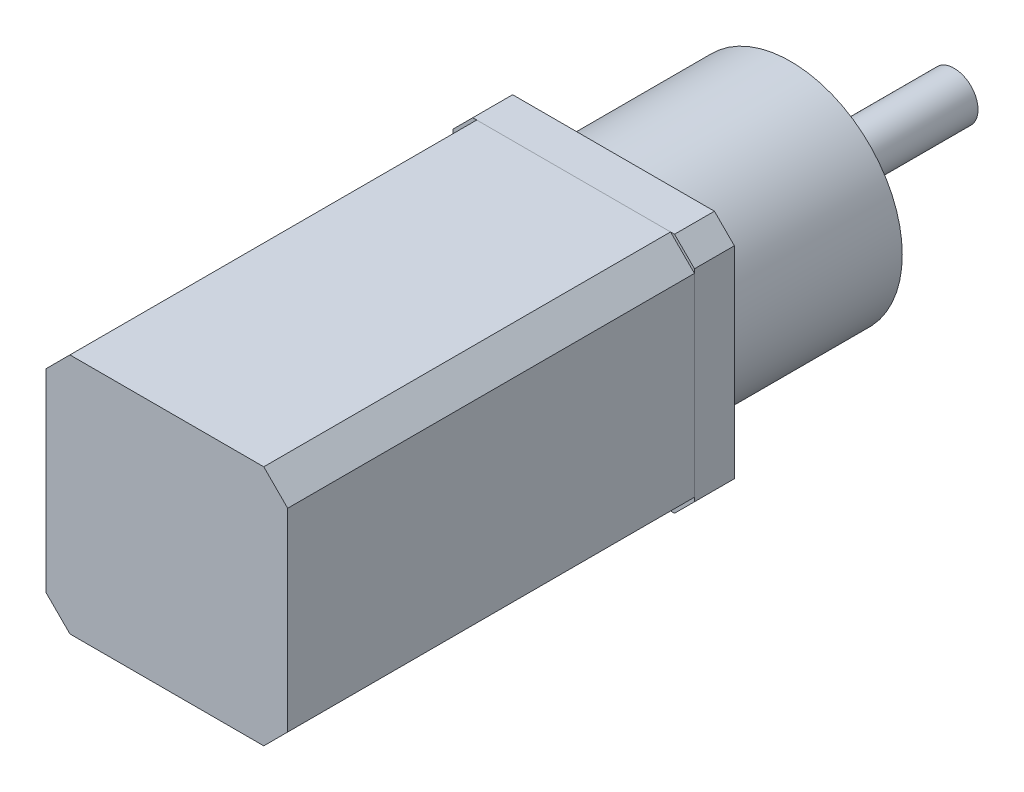
ISO-10303-21;
HEADER;
FILE_DESCRIPTION(('STEP AP214'),'2;1');
FILE_NAME('part.step','',(''),(''),'','','');
FILE_SCHEMA(('AUTOMOTIVE_DESIGN { 1 0 10303 214 1 1 1 1 }'));
ENDSEC;
DATA;
#1=APPLICATION_CONTEXT('core data for automotive mechanical design processes');
#2=APPLICATION_PROTOCOL_DEFINITION('international standard','automotive_design',2000,#1);
#3=PRODUCT_CONTEXT('',#1,'mechanical');
#4=PRODUCT('Part','Part','',(#3));
#5=PRODUCT_RELATED_PRODUCT_CATEGORY('part','',(#4));
#6=PRODUCT_DEFINITION_FORMATION('','',#4);
#7=PRODUCT_DEFINITION_CONTEXT('part definition',#1,'design');
#8=PRODUCT_DEFINITION('design','',#6,#7);
#9=PRODUCT_DEFINITION_SHAPE('','',#8);
#10=(LENGTH_UNIT() NAMED_UNIT(*) SI_UNIT(.MILLI.,.METRE.));
#11=(NAMED_UNIT(*) PLANE_ANGLE_UNIT() SI_UNIT($,.RADIAN.));
#12=(NAMED_UNIT(*) SI_UNIT($,.STERADIAN.) SOLID_ANGLE_UNIT());
#13=UNCERTAINTY_MEASURE_WITH_UNIT(LENGTH_MEASURE(1.E-05),#10,'distance_accuracy_value','');
#14=(GEOMETRIC_REPRESENTATION_CONTEXT(3) GLOBAL_UNCERTAINTY_ASSIGNED_CONTEXT((#13)) GLOBAL_UNIT_ASSIGNED_CONTEXT((#10,
#11,#12)) REPRESENTATION_CONTEXT('',''));
#15=CARTESIAN_POINT('',(0.,0.,0.));
#16=DIRECTION('',(0.,0.,1.));
#17=DIRECTION('',(1.,0.,0.));
#18=AXIS2_PLACEMENT_3D('',#15,#16,#17);
#19=CARTESIAN_POINT('',(-15.15,-15.15,-5.));
#20=DIRECTION('',(1.,0.,0.));
#21=DIRECTION('',(0.,0.,-1.));
#22=AXIS2_PLACEMENT_3D('',#19,#20,#21);
#23=PLANE('',#22);
#24=DIRECTION('',(0.,1.,0.));
#25=VECTOR('',#24,1.);
#26=CARTESIAN_POINT('',(-15.15,-15.15,-5.));
#27=LINE('',#26,#25);
#28=CARTESIAN_POINT('',(-15.15,-12.65,-5.));
#29=VERTEX_POINT('',#28);
#30=CARTESIAN_POINT('',(-15.15,12.65,-5.));
#31=VERTEX_POINT('',#30);
#32=EDGE_CURVE('E155',#29,#31,#27,.T.);
#33=ORIENTED_EDGE('',*,*,#32,.F.);
#34=DIRECTION('',(0.,0.,1.));
#35=VECTOR('',#34,1.);
#36=CARTESIAN_POINT('',(-15.15,-12.65,-5.));
#37=LINE('',#36,#35);
#38=CARTESIAN_POINT('',(-15.15,-12.65,0.));
#39=VERTEX_POINT('',#38);
#40=EDGE_CURVE('E14',#29,#39,#37,.T.);
#41=ORIENTED_EDGE('',*,*,#40,.T.);
#42=DIRECTION('',(0.,1.,0.));
#43=VECTOR('',#42,1.);
#44=CARTESIAN_POINT('',(-15.15,-15.15,0.));
#45=LINE('',#44,#43);
#46=CARTESIAN_POINT('',(-15.15,12.65,0.));
#47=VERTEX_POINT('',#46);
#48=EDGE_CURVE('E157',#39,#47,#45,.T.);
#49=ORIENTED_EDGE('',*,*,#48,.T.);
#50=DIRECTION('',(0.,0.,-1.));
#51=VECTOR('',#50,1.);
#52=CARTESIAN_POINT('',(-15.15,12.65,-5.));
#53=LINE('',#52,#51);
#54=EDGE_CURVE('E68',#47,#31,#53,.T.);
#55=ORIENTED_EDGE('',*,*,#54,.T.);
#56=EDGE_LOOP('',(#33,#41,#49,#55));
#57=FACE_BOUND('',#56,.T.);
#58=ADVANCED_FACE('F60',(#57),#23,.F.);
#59=CARTESIAN_POINT('',(15.15,15.15,-5.));
#60=DIRECTION('',(0.,-1.,0.));
#61=DIRECTION('',(0.,0.,-1.));
#62=AXIS2_PLACEMENT_3D('',#59,#60,#61);
#63=PLANE('',#62);
#64=DIRECTION('',(1.,0.,0.));
#65=VECTOR('',#64,1.);
#66=CARTESIAN_POINT('',(15.15,15.15,0.));
#67=LINE('',#66,#65);
#68=CARTESIAN_POINT('',(-12.65,15.15,0.));
#69=VERTEX_POINT('',#68);
#70=CARTESIAN_POINT('',(12.65,15.15,0.));
#71=VERTEX_POINT('',#70);
#72=EDGE_CURVE('E153',#69,#71,#67,.T.);
#73=ORIENTED_EDGE('',*,*,#72,.T.);
#74=DIRECTION('',(0.,0.,-1.));
#75=VECTOR('',#74,1.);
#76=CARTESIAN_POINT('',(12.65,15.15,-5.));
#77=LINE('',#76,#75);
#78=CARTESIAN_POINT('',(12.65,15.15,-5.));
#79=VERTEX_POINT('',#78);
#80=EDGE_CURVE('E132',#71,#79,#77,.T.);
#81=ORIENTED_EDGE('',*,*,#80,.T.);
#82=DIRECTION('',(1.,0.,0.));
#83=VECTOR('',#82,1.);
#84=CARTESIAN_POINT('',(15.15,15.15,-5.));
#85=LINE('',#84,#83);
#86=CARTESIAN_POINT('',(-12.65,15.15,-5.));
#87=VERTEX_POINT('',#86);
#88=EDGE_CURVE('E201',#87,#79,#85,.T.);
#89=ORIENTED_EDGE('',*,*,#88,.F.);
#90=DIRECTION('',(0.,0.,1.));
#91=VECTOR('',#90,1.);
#92=CARTESIAN_POINT('',(-12.65,15.15,-5.));
#93=LINE('',#92,#91);
#94=EDGE_CURVE('E137',#87,#69,#93,.T.);
#95=ORIENTED_EDGE('',*,*,#94,.T.);
#96=EDGE_LOOP('',(#73,#81,#89,#95));
#97=FACE_BOUND('',#96,.T.);
#98=ADVANCED_FACE('F205',(#97),#63,.F.);
#99=CARTESIAN_POINT('',(15.15,-15.15,-5.));
#100=DIRECTION('',(-1.,0.,0.));
#101=DIRECTION('',(0.,0.,1.));
#102=AXIS2_PLACEMENT_3D('',#99,#100,#101);
#103=PLANE('',#102);
#104=DIRECTION('',(0.,-1.,0.));
#105=VECTOR('',#104,1.);
#106=CARTESIAN_POINT('',(15.15,-15.15,-5.));
#107=LINE('',#106,#105);
#108=CARTESIAN_POINT('',(15.15,12.65,-5.));
#109=VERTEX_POINT('',#108);
#110=CARTESIAN_POINT('',(15.15,-12.65,-5.));
#111=VERTEX_POINT('',#110);
#112=EDGE_CURVE('E146',#109,#111,#107,.T.);
#113=ORIENTED_EDGE('',*,*,#112,.F.);
#114=DIRECTION('',(0.,0.,1.));
#115=VECTOR('',#114,1.);
#116=CARTESIAN_POINT('',(15.15,12.65,-5.));
#117=LINE('',#116,#115);
#118=CARTESIAN_POINT('',(15.15,12.65,0.));
#119=VERTEX_POINT('',#118);
#120=EDGE_CURVE('E131',#109,#119,#117,.T.);
#121=ORIENTED_EDGE('',*,*,#120,.T.);
#122=DIRECTION('',(0.,-1.,0.));
#123=VECTOR('',#122,1.);
#124=CARTESIAN_POINT('',(15.15,-15.15,0.));
#125=LINE('',#124,#123);
#126=CARTESIAN_POINT('',(15.15,-12.65,0.));
#127=VERTEX_POINT('',#126);
#128=EDGE_CURVE('E144',#119,#127,#125,.T.);
#129=ORIENTED_EDGE('',*,*,#128,.T.);
#130=DIRECTION('',(0.,0.,-1.));
#131=VECTOR('',#130,1.);
#132=CARTESIAN_POINT('',(15.15,-12.65,-5.));
#133=LINE('',#132,#131);
#134=EDGE_CURVE('E148',#127,#111,#133,.T.);
#135=ORIENTED_EDGE('',*,*,#134,.T.);
#136=EDGE_LOOP('',(#113,#121,#129,#135));
#137=FACE_BOUND('',#136,.T.);
#138=ADVANCED_FACE('F143',(#137),#103,.F.);
#139=CARTESIAN_POINT('',(15.15,-15.15,-5.));
#140=DIRECTION('',(0.,1.,0.));
#141=DIRECTION('',(0.,0.,1.));
#142=AXIS2_PLACEMENT_3D('',#139,#140,#141);
#143=PLANE('',#142);
#144=DIRECTION('',(-1.,0.,0.));
#145=VECTOR('',#144,1.);
#146=CARTESIAN_POINT('',(15.15,-15.15,-5.));
#147=LINE('',#146,#145);
#148=CARTESIAN_POINT('',(12.65,-15.15,-5.));
#149=VERTEX_POINT('',#148);
#150=CARTESIAN_POINT('',(-12.65,-15.15,-5.));
#151=VERTEX_POINT('',#150);
#152=EDGE_CURVE('E164',#149,#151,#147,.T.);
#153=ORIENTED_EDGE('',*,*,#152,.F.);
#154=DIRECTION('',(0.,0.,1.));
#155=VECTOR('',#154,1.);
#156=CARTESIAN_POINT('',(12.65,-15.15,-5.));
#157=LINE('',#156,#155);
#158=CARTESIAN_POINT('',(12.65,-15.15,0.));
#159=VERTEX_POINT('',#158);
#160=EDGE_CURVE('E186',#149,#159,#157,.T.);
#161=ORIENTED_EDGE('',*,*,#160,.T.);
#162=DIRECTION('',(-1.,0.,0.));
#163=VECTOR('',#162,1.);
#164=CARTESIAN_POINT('',(15.15,-15.15,0.));
#165=LINE('',#164,#163);
#166=CARTESIAN_POINT('',(-12.65,-15.15,0.));
#167=VERTEX_POINT('',#166);
#168=EDGE_CURVE('E152',#159,#167,#165,.T.);
#169=ORIENTED_EDGE('',*,*,#168,.T.);
#170=DIRECTION('',(0.,0.,-1.));
#171=VECTOR('',#170,1.);
#172=CARTESIAN_POINT('',(-12.65,-15.15,-5.));
#173=LINE('',#172,#171);
#174=EDGE_CURVE('E75',#167,#151,#173,.T.);
#175=ORIENTED_EDGE('',*,*,#174,.T.);
#176=EDGE_LOOP('',(#153,#161,#169,#175));
#177=FACE_BOUND('',#176,.T.);
#178=ADVANCED_FACE('F260',(#177),#143,.F.);
#179=CARTESIAN_POINT('',(0.,0.,-5.));
#180=DIRECTION('',(0.,0.,1.));
#181=DIRECTION('',(1.,0.,0.));
#182=AXIS2_PLACEMENT_3D('',#179,#180,#181);
#183=PLANE('',#182);
#184=CARTESIAN_POINT('',(0.,0.,-5.));
#185=DIRECTION('',(0.,0.,1.));
#186=DIRECTION('',(1.,0.,0.));
#187=AXIS2_PLACEMENT_3D('',#184,#185,#186);
#188=CIRCLE('',#187,14.);
#189=CARTESIAN_POINT('',(14.,0.,-5.));
#190=VERTEX_POINT('',#189);
#191=EDGE_CURVE('E161',#190,#190,#188,.F.);
#192=ORIENTED_EDGE('',*,*,#191,.F.);
#193=EDGE_LOOP('',(#192));
#194=FACE_BOUND('',#193,.T.);
#195=ORIENTED_EDGE('',*,*,#88,.T.);
#196=DIRECTION('',(-0.707106781186548,0.707106781186548,0.));
#197=VECTOR('',#196,1.);
#198=CARTESIAN_POINT('',(15.15,12.65,-5.));
#199=LINE('',#198,#197);
#200=EDGE_CURVE('E183',#79,#109,#199,.F.);
#201=ORIENTED_EDGE('',*,*,#200,.T.);
#202=ORIENTED_EDGE('',*,*,#112,.T.);
#203=DIRECTION('',(0.707106781186548,0.707106781186548,0.));
#204=VECTOR('',#203,1.);
#205=CARTESIAN_POINT('',(12.65,-15.15,-5.));
#206=LINE('',#205,#204);
#207=EDGE_CURVE('E82',#111,#149,#206,.F.);
#208=ORIENTED_EDGE('',*,*,#207,.T.);
#209=ORIENTED_EDGE('',*,*,#152,.T.);
#210=DIRECTION('',(0.707106781186548,-0.707106781186548,0.));
#211=VECTOR('',#210,1.);
#212=CARTESIAN_POINT('',(-15.15,-12.65,-5.));
#213=LINE('',#212,#211);
#214=EDGE_CURVE('E180',#151,#29,#213,.F.);
#215=ORIENTED_EDGE('',*,*,#214,.T.);
#216=ORIENTED_EDGE('',*,*,#32,.T.);
#217=DIRECTION('',(-0.707106781186548,-0.707106781186548,0.));
#218=VECTOR('',#217,1.);
#219=CARTESIAN_POINT('',(-12.65,15.15,-5.));
#220=LINE('',#219,#218);
#221=EDGE_CURVE('E178',#31,#87,#220,.F.);
#222=ORIENTED_EDGE('',*,*,#221,.T.);
#223=EDGE_LOOP('',(#195,#201,#202,#208,#209,#215,#216,#222));
#224=FACE_BOUND('',#223,.T.);
#225=ADVANCED_FACE('F198',(#194,#224),#183,.F.);
#226=CARTESIAN_POINT('',(0.,0.,0.));
#227=DIRECTION('',(0.,0.,1.));
#228=DIRECTION('',(1.,0.,0.));
#229=AXIS2_PLACEMENT_3D('',#226,#227,#228);
#230=PLANE('',#229);
#231=ORIENTED_EDGE('',*,*,#128,.F.);
#232=DIRECTION('',(0.707106781186548,-0.707106781186548,0.));
#233=VECTOR('',#232,1.);
#234=CARTESIAN_POINT('',(13.9,13.9,0.));
#235=LINE('',#234,#233);
#236=EDGE_CURVE('E127',#119,#71,#235,.F.);
#237=ORIENTED_EDGE('',*,*,#236,.T.);
#238=ORIENTED_EDGE('',*,*,#72,.F.);
#239=DIRECTION('',(0.707106781186548,0.707106781186548,0.));
#240=VECTOR('',#239,1.);
#241=CARTESIAN_POINT('',(-13.9,13.9,0.));
#242=LINE('',#241,#240);
#243=EDGE_CURVE('E147',#69,#47,#242,.F.);
#244=ORIENTED_EDGE('',*,*,#243,.T.);
#245=ORIENTED_EDGE('',*,*,#48,.F.);
#246=DIRECTION('',(-0.707106781186548,0.707106781186548,0.));
#247=VECTOR('',#246,1.);
#248=CARTESIAN_POINT('',(-13.9,-13.9,0.));
#249=LINE('',#248,#247);
#250=EDGE_CURVE('E172',#39,#167,#249,.F.);
#251=ORIENTED_EDGE('',*,*,#250,.T.);
#252=ORIENTED_EDGE('',*,*,#168,.F.);
#253=DIRECTION('',(-0.707106781186548,-0.707106781186548,0.));
#254=VECTOR('',#253,1.);
#255=CARTESIAN_POINT('',(13.9,-13.9,0.));
#256=LINE('',#255,#254);
#257=EDGE_CURVE('E138',#159,#127,#256,.F.);
#258=ORIENTED_EDGE('',*,*,#257,.T.);
#259=EDGE_LOOP('',(#231,#237,#238,#244,#245,#251,#252,#258));
#260=FACE_BOUND('',#259,.T.);
#261=ADVANCED_FACE('F150',(#260),#230,.T.);
#262=CARTESIAN_POINT('',(0.,0.,-27.2));
#263=DIRECTION('',(0.,0.,1.));
#264=DIRECTION('',(1.,0.,0.));
#265=AXIS2_PLACEMENT_3D('',#262,#263,#264);
#266=CYLINDRICAL_SURFACE('',#265,14.);
#267=CARTESIAN_POINT('',(0.,0.,-27.2));
#268=DIRECTION('',(0.,0.,-1.));
#269=DIRECTION('',(-1.,0.,0.));
#270=AXIS2_PLACEMENT_3D('',#267,#268,#269);
#271=CIRCLE('',#270,14.);
#272=CARTESIAN_POINT('',(-14.,0.,-27.2));
#273=VERTEX_POINT('',#272);
#274=EDGE_CURVE('E206',#273,#273,#271,.T.);
#275=ORIENTED_EDGE('',*,*,#274,.F.);
#276=EDGE_LOOP('',(#275));
#277=FACE_BOUND('',#276,.T.);
#278=ORIENTED_EDGE('',*,*,#191,.T.);
#279=EDGE_LOOP('',(#278));
#280=FACE_BOUND('',#279,.T.);
#281=ADVANCED_FACE('F250',(#277,#280),#266,.T.);
#282=CARTESIAN_POINT('',(0.,0.,-27.2));
#283=DIRECTION('',(0.,0.,-1.));
#284=DIRECTION('',(-1.,0.,0.));
#285=AXIS2_PLACEMENT_3D('',#282,#283,#284);
#286=PLANE('',#285);
#287=CARTESIAN_POINT('',(0.,0.,-27.2));
#288=DIRECTION('',(0.,0.,-1.));
#289=DIRECTION('',(-1.,0.,0.));
#290=AXIS2_PLACEMENT_3D('',#287,#288,#289);
#291=CIRCLE('',#290,9.);
#292=CARTESIAN_POINT('',(-9.,0.,-27.2));
#293=VERTEX_POINT('',#292);
#294=EDGE_CURVE('E214',#293,#293,#291,.T.);
#295=ORIENTED_EDGE('',*,*,#294,.F.);
#296=EDGE_LOOP('',(#295));
#297=FACE_BOUND('',#296,.T.);
#298=ORIENTED_EDGE('',*,*,#274,.T.);
#299=EDGE_LOOP('',(#298));
#300=FACE_BOUND('',#299,.T.);
#301=ADVANCED_FACE('F244',(#297,#300),#286,.T.);
#302=CARTESIAN_POINT('',(0.,0.,-29.2));
#303=DIRECTION('',(0.,0.,1.));
#304=DIRECTION('',(1.,0.,0.));
#305=AXIS2_PLACEMENT_3D('',#302,#303,#304);
#306=CYLINDRICAL_SURFACE('',#305,9.);
#307=CARTESIAN_POINT('',(0.,0.,-29.2));
#308=DIRECTION('',(0.,0.,-1.));
#309=DIRECTION('',(-1.,0.,0.));
#310=AXIS2_PLACEMENT_3D('',#307,#308,#309);
#311=CIRCLE('',#310,9.);
#312=CARTESIAN_POINT('',(-9.,0.,-29.2));
#313=VERTEX_POINT('',#312);
#314=EDGE_CURVE('E208',#313,#313,#311,.T.);
#315=ORIENTED_EDGE('',*,*,#314,.F.);
#316=EDGE_LOOP('',(#315));
#317=FACE_BOUND('',#316,.T.);
#318=ORIENTED_EDGE('',*,*,#294,.T.);
#319=EDGE_LOOP('',(#318));
#320=FACE_BOUND('',#319,.T.);
#321=ADVANCED_FACE('F238',(#317,#320),#306,.T.);
#322=CARTESIAN_POINT('',(0.,0.,-29.2));
#323=DIRECTION('',(0.,0.,-1.));
#324=DIRECTION('',(-1.,0.,0.));
#325=AXIS2_PLACEMENT_3D('',#322,#323,#324);
#326=PLANE('',#325);
#327=CARTESIAN_POINT('',(0.,0.,-29.2));
#328=DIRECTION('',(0.,0.,-1.));
#329=DIRECTION('',(-1.,0.,0.));
#330=AXIS2_PLACEMENT_3D('',#327,#328,#329);
#331=CIRCLE('',#330,4.32234312039916);
#332=CARTESIAN_POINT('',(-4.32234312039916,0.,-29.2));
#333=VERTEX_POINT('',#332);
#334=EDGE_CURVE('E221',#333,#333,#331,.T.);
#335=ORIENTED_EDGE('',*,*,#334,.F.);
#336=EDGE_LOOP('',(#335));
#337=FACE_BOUND('',#336,.T.);
#338=ORIENTED_EDGE('',*,*,#314,.T.);
#339=EDGE_LOOP('',(#338));
#340=FACE_BOUND('',#339,.T.);
#341=ADVANCED_FACE('F232',(#337,#340),#326,.T.);
#342=CARTESIAN_POINT('',(0.,0.,-29.6));
#343=DIRECTION('',(0.,0.,1.));
#344=DIRECTION('',(1.,0.,0.));
#345=AXIS2_PLACEMENT_3D('',#342,#343,#344);
#346=CYLINDRICAL_SURFACE('',#345,4.32234312039916);
#347=CARTESIAN_POINT('',(0.,0.,-29.6));
#348=DIRECTION('',(0.,0.,-1.));
#349=DIRECTION('',(-1.,0.,0.));
#350=AXIS2_PLACEMENT_3D('',#347,#348,#349);
#351=CIRCLE('',#350,4.32234312039916);
#352=CARTESIAN_POINT('',(-4.32234312039916,0.,-29.6));
#353=VERTEX_POINT('',#352);
#354=EDGE_CURVE('E169',#353,#353,#351,.T.);
#355=ORIENTED_EDGE('',*,*,#354,.F.);
#356=EDGE_LOOP('',(#355));
#357=FACE_BOUND('',#356,.T.);
#358=ORIENTED_EDGE('',*,*,#334,.T.);
#359=EDGE_LOOP('',(#358));
#360=FACE_BOUND('',#359,.T.);
#361=ADVANCED_FACE('F229',(#357,#360),#346,.T.);
#362=CARTESIAN_POINT('',(0.,0.,-29.6));
#363=DIRECTION('',(0.,0.,-1.));
#364=DIRECTION('',(-1.,0.,0.));
#365=AXIS2_PLACEMENT_3D('',#362,#363,#364);
#366=PLANE('',#365);
#367=CARTESIAN_POINT('',(0.,0.,-29.6));
#368=DIRECTION('',(0.,0.,-1.));
#369=DIRECTION('',(-1.,0.,0.));
#370=AXIS2_PLACEMENT_3D('',#367,#368,#369);
#371=CIRCLE('',#370,3.);
#372=CARTESIAN_POINT('',(-3.,0.,-29.6));
#373=VERTEX_POINT('',#372);
#374=EDGE_CURVE('E165',#373,#373,#371,.T.);
#375=ORIENTED_EDGE('',*,*,#374,.F.);
#376=EDGE_LOOP('',(#375));
#377=FACE_BOUND('',#376,.T.);
#378=ORIENTED_EDGE('',*,*,#354,.T.);
#379=EDGE_LOOP('',(#378));
#380=FACE_BOUND('',#379,.T.);
#381=ADVANCED_FACE('F227',(#377,#380),#366,.T.);
#382=CARTESIAN_POINT('',(0.,0.,-47.7));
#383=DIRECTION('',(0.,0.,-1.));
#384=DIRECTION('',(-1.,0.,0.));
#385=AXIS2_PLACEMENT_3D('',#382,#383,#384);
#386=PLANE('',#385);
#387=CARTESIAN_POINT('',(0.,0.,-47.7));
#388=DIRECTION('',(0.,0.,-1.));
#389=DIRECTION('',(-1.,0.,0.));
#390=AXIS2_PLACEMENT_3D('',#387,#388,#389);
#391=CIRCLE('',#390,3.);
#392=CARTESIAN_POINT('',(-3.,0.,-47.7));
#393=VERTEX_POINT('',#392);
#394=EDGE_CURVE('E168',#393,#393,#391,.T.);
#395=ORIENTED_EDGE('',*,*,#394,.T.);
#396=EDGE_LOOP('',(#395));
#397=FACE_BOUND('',#396,.T.);
#398=ADVANCED_FACE('F350',(#397),#386,.T.);
#399=CARTESIAN_POINT('',(0.,0.,-47.7));
#400=DIRECTION('',(0.,0.,1.));
#401=DIRECTION('',(1.,0.,0.));
#402=AXIS2_PLACEMENT_3D('',#399,#400,#401);
#403=CYLINDRICAL_SURFACE('',#402,3.);
#404=ORIENTED_EDGE('',*,*,#374,.T.);
#405=EDGE_LOOP('',(#404));
#406=FACE_BOUND('',#405,.T.);
#407=ORIENTED_EDGE('',*,*,#394,.F.);
#408=EDGE_LOOP('',(#407));
#409=FACE_BOUND('',#408,.T.);
#410=ADVANCED_FACE('F279',(#406,#409),#403,.T.);
#411=CARTESIAN_POINT('',(15.15,12.65,-5.));
#412=DIRECTION('',(-0.707106781186547,-0.707106781186547,0.));
#413=DIRECTION('',(0.,0.,1.));
#414=AXIS2_PLACEMENT_3D('',#411,#412,#413);
#415=PLANE('',#414);
#416=ORIENTED_EDGE('',*,*,#200,.F.);
#417=ORIENTED_EDGE('',*,*,#80,.F.);
#418=ORIENTED_EDGE('',*,*,#236,.F.);
#419=ORIENTED_EDGE('',*,*,#120,.F.);
#420=EDGE_LOOP('',(#416,#417,#418,#419));
#421=FACE_BOUND('',#420,.T.);
#422=ADVANCED_FACE('F130',(#421),#415,.F.);
#423=CARTESIAN_POINT('',(12.65,-15.15,-5.));
#424=DIRECTION('',(-0.707106781186547,0.707106781186547,0.));
#425=DIRECTION('',(0.,0.,1.));
#426=AXIS2_PLACEMENT_3D('',#423,#424,#425);
#427=PLANE('',#426);
#428=ORIENTED_EDGE('',*,*,#207,.F.);
#429=ORIENTED_EDGE('',*,*,#134,.F.);
#430=ORIENTED_EDGE('',*,*,#257,.F.);
#431=ORIENTED_EDGE('',*,*,#160,.F.);
#432=EDGE_LOOP('',(#428,#429,#430,#431));
#433=FACE_BOUND('',#432,.T.);
#434=ADVANCED_FACE('F278',(#433),#427,.F.);
#435=CARTESIAN_POINT('',(-15.15,-12.65,-5.));
#436=DIRECTION('',(0.707106781186547,0.707106781186547,0.));
#437=DIRECTION('',(0.,0.,1.));
#438=AXIS2_PLACEMENT_3D('',#435,#436,#437);
#439=PLANE('',#438);
#440=ORIENTED_EDGE('',*,*,#214,.F.);
#441=ORIENTED_EDGE('',*,*,#174,.F.);
#442=ORIENTED_EDGE('',*,*,#250,.F.);
#443=ORIENTED_EDGE('',*,*,#40,.F.);
#444=EDGE_LOOP('',(#440,#441,#442,#443));
#445=FACE_BOUND('',#444,.T.);
#446=ADVANCED_FACE('F281',(#445),#439,.F.);
#447=CARTESIAN_POINT('',(-12.65,15.15,-5.));
#448=DIRECTION('',(0.707106781186547,-0.707106781186547,0.));
#449=DIRECTION('',(0.,0.,1.));
#450=AXIS2_PLACEMENT_3D('',#447,#448,#449);
#451=PLANE('',#450);
#452=ORIENTED_EDGE('',*,*,#221,.F.);
#453=ORIENTED_EDGE('',*,*,#54,.F.);
#454=ORIENTED_EDGE('',*,*,#243,.F.);
#455=ORIENTED_EDGE('',*,*,#94,.F.);
#456=EDGE_LOOP('',(#452,#453,#454,#455));
#457=FACE_BOUND('',#456,.T.);
#458=ADVANCED_FACE('F62',(#457),#451,.F.);
#459=CLOSED_SHELL('',(#58,#98,#138,#178,#225,#261,#281,#301,#321,#341,#361,#381,#398,#410,#422,
#434,#446,#458));
#460=MANIFOLD_SOLID_BREP('B2',#459);
#461=CARTESIAN_POINT('',(15.15,15.15,51.));
#462=DIRECTION('',(-1.,0.,0.));
#463=DIRECTION('',(0.,-1.,0.));
#464=AXIS2_PLACEMENT_3D('',#461,#462,#463);
#465=PLANE('',#464);
#466=DIRECTION('',(0.,1.,0.));
#467=VECTOR('',#466,1.);
#468=CARTESIAN_POINT('',(15.15,15.15,51.));
#469=LINE('',#468,#467);
#470=CARTESIAN_POINT('',(15.15,-12.15,51.));
#471=VERTEX_POINT('',#470);
#472=CARTESIAN_POINT('',(15.15,12.15,51.));
#473=VERTEX_POINT('',#472);
#474=EDGE_CURVE('E500',#471,#473,#469,.T.);
#475=ORIENTED_EDGE('',*,*,#474,.F.);
#476=DIRECTION('',(0.,0.,-1.));
#477=VECTOR('',#476,1.);
#478=CARTESIAN_POINT('',(15.15,-12.15,51.));
#479=LINE('',#478,#477);
#480=CARTESIAN_POINT('',(15.15,-12.15,0.));
#481=VERTEX_POINT('',#480);
#482=EDGE_CURVE('E526',#471,#481,#479,.T.);
#483=ORIENTED_EDGE('',*,*,#482,.T.);
#484=DIRECTION('',(0.,1.,0.));
#485=VECTOR('',#484,1.);
#486=CARTESIAN_POINT('',(15.15,15.15,0.));
#487=LINE('',#486,#485);
#488=CARTESIAN_POINT('',(15.15,12.15,0.));
#489=VERTEX_POINT('',#488);
#490=EDGE_CURVE('E534',#481,#489,#487,.T.);
#491=ORIENTED_EDGE('',*,*,#490,.T.);
#492=DIRECTION('',(0.,0.,1.));
#493=VECTOR('',#492,1.);
#494=CARTESIAN_POINT('',(15.15,12.15,51.));
#495=LINE('',#494,#493);
#496=EDGE_CURVE('E524',#489,#473,#495,.T.);
#497=ORIENTED_EDGE('',*,*,#496,.T.);
#498=EDGE_LOOP('',(#475,#483,#491,#497));
#499=FACE_BOUND('',#498,.T.);
#500=ADVANCED_FACE('F409',(#499),#465,.F.);
#501=CARTESIAN_POINT('',(-15.15,15.15,51.));
#502=DIRECTION('',(0.,-1.,0.));
#503=DIRECTION('',(0.,0.,-1.));
#504=AXIS2_PLACEMENT_3D('',#501,#502,#503);
#505=PLANE('',#504);
#506=DIRECTION('',(-1.,0.,0.));
#507=VECTOR('',#506,1.);
#508=CARTESIAN_POINT('',(-15.15,15.15,0.));
#509=LINE('',#508,#507);
#510=CARTESIAN_POINT('',(12.15,15.15,0.));
#511=VERTEX_POINT('',#510);
#512=CARTESIAN_POINT('',(-12.15,15.15,0.));
#513=VERTEX_POINT('',#512);
#514=EDGE_CURVE('E505',#511,#513,#509,.T.);
#515=ORIENTED_EDGE('',*,*,#514,.T.);
#516=DIRECTION('',(0.,0.,1.));
#517=VECTOR('',#516,1.);
#518=CARTESIAN_POINT('',(-12.15,15.15,51.));
#519=LINE('',#518,#517);
#520=CARTESIAN_POINT('',(-12.15,15.15,51.));
#521=VERTEX_POINT('',#520);
#522=EDGE_CURVE('E58',#513,#521,#519,.T.);
#523=ORIENTED_EDGE('',*,*,#522,.T.);
#524=DIRECTION('',(-1.,0.,0.));
#525=VECTOR('',#524,1.);
#526=CARTESIAN_POINT('',(-15.15,15.15,51.));
#527=LINE('',#526,#525);
#528=CARTESIAN_POINT('',(12.15,15.15,51.));
#529=VERTEX_POINT('',#528);
#530=EDGE_CURVE('E503',#529,#521,#527,.T.);
#531=ORIENTED_EDGE('',*,*,#530,.F.);
#532=DIRECTION('',(0.,0.,-1.));
#533=VECTOR('',#532,1.);
#534=CARTESIAN_POINT('',(12.15,15.15,51.));
#535=LINE('',#534,#533);
#536=EDGE_CURVE('E417',#529,#511,#535,.T.);
#537=ORIENTED_EDGE('',*,*,#536,.T.);
#538=EDGE_LOOP('',(#515,#523,#531,#537));
#539=FACE_BOUND('',#538,.T.);
#540=ADVANCED_FACE('F531',(#539),#505,.F.);
#541=CARTESIAN_POINT('',(-15.15,15.15,51.));
#542=DIRECTION('',(1.,0.,0.));
#543=DIRECTION('',(0.,1.,0.));
#544=AXIS2_PLACEMENT_3D('',#541,#542,#543);
#545=PLANE('',#544);
#546=DIRECTION('',(0.,-1.,0.));
#547=VECTOR('',#546,1.);
#548=CARTESIAN_POINT('',(-15.15,15.15,0.));
#549=LINE('',#548,#547);
#550=CARTESIAN_POINT('',(-15.15,12.15,0.));
#551=VERTEX_POINT('',#550);
#552=CARTESIAN_POINT('',(-15.15,-12.15,0.));
#553=VERTEX_POINT('',#552);
#554=EDGE_CURVE('E501',#551,#553,#549,.T.);
#555=ORIENTED_EDGE('',*,*,#554,.T.);
#556=DIRECTION('',(0.,0.,1.));
#557=VECTOR('',#556,1.);
#558=CARTESIAN_POINT('',(-15.15,-12.15,51.));
#559=LINE('',#558,#557);
#560=CARTESIAN_POINT('',(-15.15,-12.15,51.));
#561=VERTEX_POINT('',#560);
#562=EDGE_CURVE('E479',#553,#561,#559,.T.);
#563=ORIENTED_EDGE('',*,*,#562,.T.);
#564=DIRECTION('',(0.,-1.,0.));
#565=VECTOR('',#564,1.);
#566=CARTESIAN_POINT('',(-15.15,15.15,51.));
#567=LINE('',#566,#565);
#568=CARTESIAN_POINT('',(-15.15,12.15,51.));
#569=VERTEX_POINT('',#568);
#570=EDGE_CURVE('E538',#569,#561,#567,.T.);
#571=ORIENTED_EDGE('',*,*,#570,.F.);
#572=DIRECTION('',(0.,0.,-1.));
#573=VECTOR('',#572,1.);
#574=CARTESIAN_POINT('',(-15.15,12.15,51.));
#575=LINE('',#574,#573);
#576=EDGE_CURVE('E484',#569,#551,#575,.T.);
#577=ORIENTED_EDGE('',*,*,#576,.T.);
#578=EDGE_LOOP('',(#555,#563,#571,#577));
#579=FACE_BOUND('',#578,.T.);
#580=ADVANCED_FACE('F548',(#579),#545,.F.);
#581=CARTESIAN_POINT('',(-15.15,-15.15,51.));
#582=DIRECTION('',(0.,1.,0.));
#583=DIRECTION('',(0.,0.,1.));
#584=AXIS2_PLACEMENT_3D('',#581,#582,#583);
#585=PLANE('',#584);
#586=DIRECTION('',(1.,0.,0.));
#587=VECTOR('',#586,1.);
#588=CARTESIAN_POINT('',(-15.15,-15.15,51.));
#589=LINE('',#588,#587);
#590=CARTESIAN_POINT('',(-12.15,-15.15,51.));
#591=VERTEX_POINT('',#590);
#592=CARTESIAN_POINT('',(12.15,-15.15,51.));
#593=VERTEX_POINT('',#592);
#594=EDGE_CURVE('E494',#591,#593,#589,.T.);
#595=ORIENTED_EDGE('',*,*,#594,.F.);
#596=DIRECTION('',(0.,0.,-1.));
#597=VECTOR('',#596,1.);
#598=CARTESIAN_POINT('',(-12.15,-15.15,51.));
#599=LINE('',#598,#597);
#600=CARTESIAN_POINT('',(-12.15,-15.15,0.));
#601=VERTEX_POINT('',#600);
#602=EDGE_CURVE('E478',#591,#601,#599,.T.);
#603=ORIENTED_EDGE('',*,*,#602,.T.);
#604=DIRECTION('',(1.,0.,0.));
#605=VECTOR('',#604,1.);
#606=CARTESIAN_POINT('',(-15.15,-15.15,0.));
#607=LINE('',#606,#605);
#608=CARTESIAN_POINT('',(12.15,-15.15,0.));
#609=VERTEX_POINT('',#608);
#610=EDGE_CURVE('E491',#601,#609,#607,.T.);
#611=ORIENTED_EDGE('',*,*,#610,.T.);
#612=DIRECTION('',(0.,0.,1.));
#613=VECTOR('',#612,1.);
#614=CARTESIAN_POINT('',(12.15,-15.15,51.));
#615=LINE('',#614,#613);
#616=EDGE_CURVE('E496',#609,#593,#615,.T.);
#617=ORIENTED_EDGE('',*,*,#616,.T.);
#618=EDGE_LOOP('',(#595,#603,#611,#617));
#619=FACE_BOUND('',#618,.T.);
#620=ADVANCED_FACE('F490',(#619),#585,.F.);
#621=CARTESIAN_POINT('',(0.,0.,51.));
#622=DIRECTION('',(0.,0.,1.));
#623=DIRECTION('',(1.,0.,0.));
#624=AXIS2_PLACEMENT_3D('',#621,#622,#623);
#625=PLANE('',#624);
#626=ORIENTED_EDGE('',*,*,#570,.T.);
#627=DIRECTION('',(-0.707106781186547,0.707106781186548,0.));
#628=VECTOR('',#627,1.);
#629=CARTESIAN_POINT('',(-13.65,-13.65,51.));
#630=LINE('',#629,#628);
#631=EDGE_CURVE('E522',#561,#591,#630,.F.);
#632=ORIENTED_EDGE('',*,*,#631,.T.);
#633=ORIENTED_EDGE('',*,*,#594,.T.);
#634=DIRECTION('',(-0.707106781186548,-0.707106781186547,0.));
#635=VECTOR('',#634,1.);
#636=CARTESIAN_POINT('',(13.65,-13.65,51.));
#637=LINE('',#636,#635);
#638=EDGE_CURVE('E520',#593,#471,#637,.F.);
#639=ORIENTED_EDGE('',*,*,#638,.T.);
#640=ORIENTED_EDGE('',*,*,#474,.T.);
#641=DIRECTION('',(0.707106781186547,-0.707106781186548,0.));
#642=VECTOR('',#641,1.);
#643=CARTESIAN_POINT('',(13.65,13.65,51.));
#644=LINE('',#643,#642);
#645=EDGE_CURVE('E429',#473,#529,#644,.F.);
#646=ORIENTED_EDGE('',*,*,#645,.T.);
#647=ORIENTED_EDGE('',*,*,#530,.T.);
#648=DIRECTION('',(0.707106781186548,0.707106781186547,0.));
#649=VECTOR('',#648,1.);
#650=CARTESIAN_POINT('',(-13.65,13.65,51.));
#651=LINE('',#650,#649);
#652=EDGE_CURVE('E518',#521,#569,#651,.F.);
#653=ORIENTED_EDGE('',*,*,#652,.T.);
#654=EDGE_LOOP('',(#626,#632,#633,#639,#640,#646,#647,#653));
#655=FACE_BOUND('',#654,.T.);
#656=ADVANCED_FACE('F542',(#655),#625,.T.);
#657=CARTESIAN_POINT('',(0.,0.,0.));
#658=DIRECTION('',(0.,0.,1.));
#659=DIRECTION('',(1.,0.,0.));
#660=AXIS2_PLACEMENT_3D('',#657,#658,#659);
#661=PLANE('',#660);
#662=ORIENTED_EDGE('',*,*,#610,.F.);
#663=DIRECTION('',(0.707106781186547,-0.707106781186548,0.));
#664=VECTOR('',#663,1.);
#665=CARTESIAN_POINT('',(-12.15,-15.15,0.));
#666=LINE('',#665,#664);
#667=EDGE_CURVE('E474',#601,#553,#666,.F.);
#668=ORIENTED_EDGE('',*,*,#667,.T.);
#669=ORIENTED_EDGE('',*,*,#554,.F.);
#670=DIRECTION('',(-0.707106781186548,-0.707106781186547,0.));
#671=VECTOR('',#670,1.);
#672=CARTESIAN_POINT('',(-15.15,12.15,0.));
#673=LINE('',#672,#671);
#674=EDGE_CURVE('E511',#551,#513,#673,.F.);
#675=ORIENTED_EDGE('',*,*,#674,.T.);
#676=ORIENTED_EDGE('',*,*,#514,.F.);
#677=DIRECTION('',(-0.707106781186547,0.707106781186548,0.));
#678=VECTOR('',#677,1.);
#679=CARTESIAN_POINT('',(12.15,15.15,0.));
#680=LINE('',#679,#678);
#681=EDGE_CURVE('E495',#511,#489,#680,.F.);
#682=ORIENTED_EDGE('',*,*,#681,.T.);
#683=ORIENTED_EDGE('',*,*,#490,.F.);
#684=DIRECTION('',(0.707106781186548,0.707106781186547,0.));
#685=VECTOR('',#684,1.);
#686=CARTESIAN_POINT('',(15.15,-12.15,0.));
#687=LINE('',#686,#685);
#688=EDGE_CURVE('E485',#481,#609,#687,.F.);
#689=ORIENTED_EDGE('',*,*,#688,.T.);
#690=EDGE_LOOP('',(#662,#668,#669,#675,#676,#682,#683,#689));
#691=FACE_BOUND('',#690,.T.);
#692=ADVANCED_FACE('F498',(#691),#661,.F.);
#693=CARTESIAN_POINT('',(-12.15,-15.15,51.));
#694=DIRECTION('',(0.707106781186548,0.707106781186547,0.));
#695=DIRECTION('',(0.,0.,-1.));
#696=AXIS2_PLACEMENT_3D('',#693,#694,#695);
#697=PLANE('',#696);
#698=ORIENTED_EDGE('',*,*,#631,.F.);
#699=ORIENTED_EDGE('',*,*,#562,.F.);
#700=ORIENTED_EDGE('',*,*,#667,.F.);
#701=ORIENTED_EDGE('',*,*,#602,.F.);
#702=EDGE_LOOP('',(#698,#699,#700,#701));
#703=FACE_BOUND('',#702,.T.);
#704=ADVANCED_FACE('F477',(#703),#697,.F.);
#705=CARTESIAN_POINT('',(15.15,-12.15,51.));
#706=DIRECTION('',(-0.707106781186547,0.707106781186548,0.));
#707=DIRECTION('',(0.,0.,-1.));
#708=AXIS2_PLACEMENT_3D('',#705,#706,#707);
#709=PLANE('',#708);
#710=ORIENTED_EDGE('',*,*,#638,.F.);
#711=ORIENTED_EDGE('',*,*,#616,.F.);
#712=ORIENTED_EDGE('',*,*,#688,.F.);
#713=ORIENTED_EDGE('',*,*,#482,.F.);
#714=EDGE_LOOP('',(#710,#711,#712,#713));
#715=FACE_BOUND('',#714,.T.);
#716=ADVANCED_FACE('F553',(#715),#709,.F.);
#717=CARTESIAN_POINT('',(-15.15,12.15,51.));
#718=DIRECTION('',(0.707106781186547,-0.707106781186548,0.));
#719=DIRECTION('',(0.,0.,-1.));
#720=AXIS2_PLACEMENT_3D('',#717,#718,#719);
#721=PLANE('',#720);
#722=ORIENTED_EDGE('',*,*,#652,.F.);
#723=ORIENTED_EDGE('',*,*,#522,.F.);
#724=ORIENTED_EDGE('',*,*,#674,.F.);
#725=ORIENTED_EDGE('',*,*,#576,.F.);
#726=EDGE_LOOP('',(#722,#723,#724,#725));
#727=FACE_BOUND('',#726,.T.);
#728=ADVANCED_FACE('F546',(#727),#721,.F.);
#729=CARTESIAN_POINT('',(12.15,15.15,51.));
#730=DIRECTION('',(-0.707106781186548,-0.707106781186547,0.));
#731=DIRECTION('',(0.,0.,-1.));
#732=AXIS2_PLACEMENT_3D('',#729,#730,#731);
#733=PLANE('',#732);
#734=ORIENTED_EDGE('',*,*,#645,.F.);
#735=ORIENTED_EDGE('',*,*,#496,.F.);
#736=ORIENTED_EDGE('',*,*,#681,.F.);
#737=ORIENTED_EDGE('',*,*,#536,.F.);
#738=EDGE_LOOP('',(#734,#735,#736,#737));
#739=FACE_BOUND('',#738,.T.);
#740=ADVANCED_FACE('F411',(#739),#733,.F.);
#741=CLOSED_SHELL('',(#500,#540,#580,#620,#656,#692,#704,#716,#728,#740));
#742=MANIFOLD_SOLID_BREP('B8',#741);
#743=ADVANCED_BREP_SHAPE_REPRESENTATION('',(#18,#460,#742),#14);
#744=SHAPE_DEFINITION_REPRESENTATION(#9,#743);
ENDSEC;
END-ISO-10303-21;
